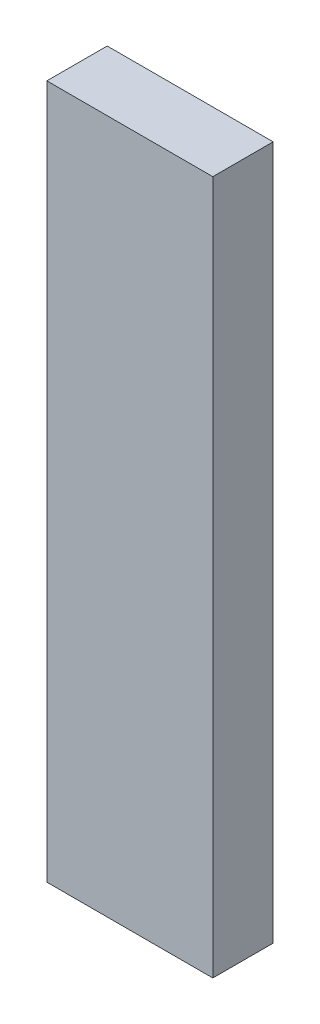
ISO-10303-21;
HEADER;
FILE_DESCRIPTION(('STEP AP214'),'2;1');
FILE_NAME('part.step','',(''),(''),'','','');
FILE_SCHEMA(('AUTOMOTIVE_DESIGN { 1 0 10303 214 1 1 1 1 }'));
ENDSEC;
DATA;
#1=APPLICATION_CONTEXT('core data for automotive mechanical design processes');
#2=APPLICATION_PROTOCOL_DEFINITION('international standard','automotive_design',2000,#1);
#3=PRODUCT_CONTEXT('',#1,'mechanical');
#4=PRODUCT('Part','Part','',(#3));
#5=PRODUCT_RELATED_PRODUCT_CATEGORY('part','',(#4));
#6=PRODUCT_DEFINITION_FORMATION('','',#4);
#7=PRODUCT_DEFINITION_CONTEXT('part definition',#1,'design');
#8=PRODUCT_DEFINITION('design','',#6,#7);
#9=PRODUCT_DEFINITION_SHAPE('','',#8);
#10=(LENGTH_UNIT() NAMED_UNIT(*) SI_UNIT(.MILLI.,.METRE.));
#11=(NAMED_UNIT(*) PLANE_ANGLE_UNIT() SI_UNIT($,.RADIAN.));
#12=(NAMED_UNIT(*) SI_UNIT($,.STERADIAN.) SOLID_ANGLE_UNIT());
#13=UNCERTAINTY_MEASURE_WITH_UNIT(LENGTH_MEASURE(1.E-05),#10,'distance_accuracy_value','');
#14=(GEOMETRIC_REPRESENTATION_CONTEXT(3) GLOBAL_UNCERTAINTY_ASSIGNED_CONTEXT((#13)) GLOBAL_UNIT_ASSIGNED_CONTEXT((#10,
#11,#12)) REPRESENTATION_CONTEXT('',''));
#15=CARTESIAN_POINT('',(0.,0.,0.));
#16=DIRECTION('',(0.,0.,1.));
#17=DIRECTION('',(1.,0.,0.));
#18=AXIS2_PLACEMENT_3D('',#15,#16,#17);
#19=CARTESIAN_POINT('',(27.5,230.,-10.));
#20=DIRECTION('',(-1.,0.,0.));
#21=DIRECTION('',(0.,0.,1.));
#22=AXIS2_PLACEMENT_3D('',#19,#20,#21);
#23=PLANE('',#22);
#24=DIRECTION('',(0.,0.,-1.));
#25=VECTOR('',#24,1.);
#26=CARTESIAN_POINT('',(27.5,0.,-10.));
#27=LINE('',#26,#25);
#28=CARTESIAN_POINT('',(27.5,0.,10.));
#29=VERTEX_POINT('',#28);
#30=CARTESIAN_POINT('',(27.5,0.,-10.));
#31=VERTEX_POINT('',#30);
#32=EDGE_CURVE('E97',#29,#31,#27,.T.);
#33=ORIENTED_EDGE('',*,*,#32,.T.);
#34=DIRECTION('',(0.,-1.,0.));
#35=VECTOR('',#34,1.);
#36=CARTESIAN_POINT('',(27.5,230.,-10.));
#37=LINE('',#36,#35);
#38=CARTESIAN_POINT('',(27.5,230.,-10.));
#39=VERTEX_POINT('',#38);
#40=EDGE_CURVE('E11',#39,#31,#37,.T.);
#41=ORIENTED_EDGE('',*,*,#40,.F.);
#42=DIRECTION('',(0.,0.,-1.));
#43=VECTOR('',#42,1.);
#44=CARTESIAN_POINT('',(27.5,230.,-10.));
#45=LINE('',#44,#43);
#46=CARTESIAN_POINT('',(27.5,230.,10.));
#47=VERTEX_POINT('',#46);
#48=EDGE_CURVE('E85',#47,#39,#45,.T.);
#49=ORIENTED_EDGE('',*,*,#48,.F.);
#50=DIRECTION('',(0.,-1.,0.));
#51=VECTOR('',#50,1.);
#52=CARTESIAN_POINT('',(27.5,230.,10.));
#53=LINE('',#52,#51);
#54=EDGE_CURVE('E93',#47,#29,#53,.T.);
#55=ORIENTED_EDGE('',*,*,#54,.T.);
#56=EDGE_LOOP('',(#33,#41,#49,#55));
#57=FACE_BOUND('',#56,.T.);
#58=ADVANCED_FACE('F34',(#57),#23,.F.);
#59=CARTESIAN_POINT('',(-27.5,230.,-10.));
#60=DIRECTION('',(0.,0.,1.));
#61=DIRECTION('',(1.,0.,0.));
#62=AXIS2_PLACEMENT_3D('',#59,#60,#61);
#63=PLANE('',#62);
#64=DIRECTION('',(-1.,0.,0.));
#65=VECTOR('',#64,1.);
#66=CARTESIAN_POINT('',(-27.5,0.,-10.));
#67=LINE('',#66,#65);
#68=CARTESIAN_POINT('',(-27.5,0.,-10.));
#69=VERTEX_POINT('',#68);
#70=EDGE_CURVE('E89',#31,#69,#67,.T.);
#71=ORIENTED_EDGE('',*,*,#70,.T.);
#72=DIRECTION('',(0.,-1.,0.));
#73=VECTOR('',#72,1.);
#74=CARTESIAN_POINT('',(-27.5,230.,-10.));
#75=LINE('',#74,#73);
#76=CARTESIAN_POINT('',(-27.5,230.,-10.));
#77=VERTEX_POINT('',#76);
#78=EDGE_CURVE('E42',#77,#69,#75,.T.);
#79=ORIENTED_EDGE('',*,*,#78,.F.);
#80=DIRECTION('',(-1.,0.,0.));
#81=VECTOR('',#80,1.);
#82=CARTESIAN_POINT('',(-27.5,230.,-10.));
#83=LINE('',#82,#81);
#84=EDGE_CURVE('E80',#39,#77,#83,.T.);
#85=ORIENTED_EDGE('',*,*,#84,.F.);
#86=ORIENTED_EDGE('',*,*,#40,.T.);
#87=EDGE_LOOP('',(#71,#79,#85,#86));
#88=FACE_BOUND('',#87,.T.);
#89=ADVANCED_FACE('F88',(#88),#63,.F.);
#90=CARTESIAN_POINT('',(-27.5,230.,-10.));
#91=DIRECTION('',(1.,0.,0.));
#92=DIRECTION('',(0.,0.,-1.));
#93=AXIS2_PLACEMENT_3D('',#90,#91,#92);
#94=PLANE('',#93);
#95=DIRECTION('',(0.,0.,1.));
#96=VECTOR('',#95,1.);
#97=CARTESIAN_POINT('',(-27.5,0.,-10.));
#98=LINE('',#97,#96);
#99=CARTESIAN_POINT('',(-27.5,0.,10.));
#100=VERTEX_POINT('',#99);
#101=EDGE_CURVE('E67',#69,#100,#98,.T.);
#102=ORIENTED_EDGE('',*,*,#101,.T.);
#103=DIRECTION('',(0.,-1.,0.));
#104=VECTOR('',#103,1.);
#105=CARTESIAN_POINT('',(-27.5,230.,10.));
#106=LINE('',#105,#104);
#107=CARTESIAN_POINT('',(-27.5,230.,10.));
#108=VERTEX_POINT('',#107);
#109=EDGE_CURVE('E90',#108,#100,#106,.T.);
#110=ORIENTED_EDGE('',*,*,#109,.F.);
#111=DIRECTION('',(0.,0.,1.));
#112=VECTOR('',#111,1.);
#113=CARTESIAN_POINT('',(-27.5,230.,-10.));
#114=LINE('',#113,#112);
#115=EDGE_CURVE('E83',#77,#108,#114,.T.);
#116=ORIENTED_EDGE('',*,*,#115,.F.);
#117=ORIENTED_EDGE('',*,*,#78,.T.);
#118=EDGE_LOOP('',(#102,#110,#116,#117));
#119=FACE_BOUND('',#118,.T.);
#120=ADVANCED_FACE('F91',(#119),#94,.F.);
#121=CARTESIAN_POINT('',(-27.5,230.,10.));
#122=DIRECTION('',(0.,0.,-1.));
#123=DIRECTION('',(-1.,0.,0.));
#124=AXIS2_PLACEMENT_3D('',#121,#122,#123);
#125=PLANE('',#124);
#126=DIRECTION('',(1.,0.,0.));
#127=VECTOR('',#126,1.);
#128=CARTESIAN_POINT('',(-27.5,0.,10.));
#129=LINE('',#128,#127);
#130=EDGE_CURVE('E73',#100,#29,#129,.T.);
#131=ORIENTED_EDGE('',*,*,#130,.T.);
#132=ORIENTED_EDGE('',*,*,#54,.F.);
#133=DIRECTION('',(1.,0.,0.));
#134=VECTOR('',#133,1.);
#135=CARTESIAN_POINT('',(-27.5,230.,10.));
#136=LINE('',#135,#134);
#137=EDGE_CURVE('E50',#108,#47,#136,.T.);
#138=ORIENTED_EDGE('',*,*,#137,.F.);
#139=ORIENTED_EDGE('',*,*,#109,.T.);
#140=EDGE_LOOP('',(#131,#132,#138,#139));
#141=FACE_BOUND('',#140,.T.);
#142=ADVANCED_FACE('F104',(#141),#125,.F.);
#143=CARTESIAN_POINT('',(0.,230.,0.));
#144=DIRECTION('',(0.,1.,0.));
#145=DIRECTION('',(0.,0.,1.));
#146=AXIS2_PLACEMENT_3D('',#143,#144,#145);
#147=PLANE('',#146);
#148=ORIENTED_EDGE('',*,*,#48,.T.);
#149=ORIENTED_EDGE('',*,*,#84,.T.);
#150=ORIENTED_EDGE('',*,*,#115,.T.);
#151=ORIENTED_EDGE('',*,*,#137,.T.);
#152=EDGE_LOOP('',(#148,#149,#150,#151));
#153=FACE_BOUND('',#152,.T.);
#154=ADVANCED_FACE('F81',(#153),#147,.T.);
#155=CARTESIAN_POINT('',(0.,0.,0.));
#156=DIRECTION('',(0.,1.,0.));
#157=DIRECTION('',(0.,0.,1.));
#158=AXIS2_PLACEMENT_3D('',#155,#156,#157);
#159=PLANE('',#158);
#160=ORIENTED_EDGE('',*,*,#32,.F.);
#161=ORIENTED_EDGE('',*,*,#130,.F.);
#162=ORIENTED_EDGE('',*,*,#101,.F.);
#163=ORIENTED_EDGE('',*,*,#70,.F.);
#164=EDGE_LOOP('',(#160,#161,#162,#163));
#165=FACE_BOUND('',#164,.T.);
#166=ADVANCED_FACE('F107',(#165),#159,.F.);
#167=CLOSED_SHELL('',(#58,#89,#120,#142,#154,#166));
#168=MANIFOLD_SOLID_BREP('B2',#167);
#169=ADVANCED_BREP_SHAPE_REPRESENTATION('',(#18,#168),#14);
#170=SHAPE_DEFINITION_REPRESENTATION(#9,#169);
ENDSEC;
END-ISO-10303-21;
